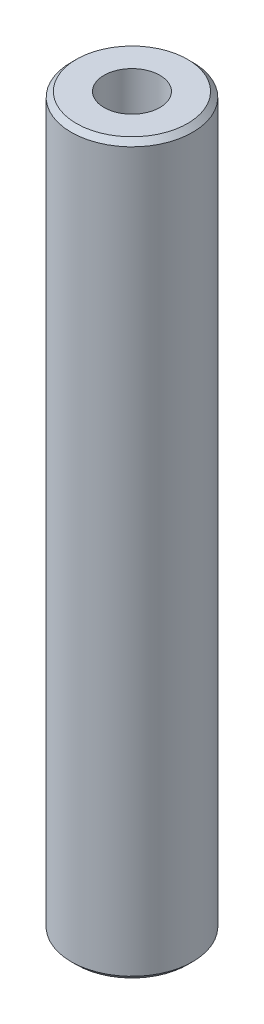
ISO-10303-21;
HEADER;
FILE_DESCRIPTION(('STEP AP214'),'2;1');
FILE_NAME('part.step','',(''),(''),'','','');
FILE_SCHEMA(('AUTOMOTIVE_DESIGN { 1 0 10303 214 1 1 1 1 }'));
ENDSEC;
DATA;
#1=APPLICATION_CONTEXT('core data for automotive mechanical design processes');
#2=APPLICATION_PROTOCOL_DEFINITION('international standard','automotive_design',2000,#1);
#3=PRODUCT_CONTEXT('',#1,'mechanical');
#4=PRODUCT('Part','Part','',(#3));
#5=PRODUCT_RELATED_PRODUCT_CATEGORY('part','',(#4));
#6=PRODUCT_DEFINITION_FORMATION('','',#4);
#7=PRODUCT_DEFINITION_CONTEXT('part definition',#1,'design');
#8=PRODUCT_DEFINITION('design','',#6,#7);
#9=PRODUCT_DEFINITION_SHAPE('','',#8);
#10=(LENGTH_UNIT() NAMED_UNIT(*) SI_UNIT(.MILLI.,.METRE.));
#11=(NAMED_UNIT(*) PLANE_ANGLE_UNIT() SI_UNIT($,.RADIAN.));
#12=(NAMED_UNIT(*) SI_UNIT($,.STERADIAN.) SOLID_ANGLE_UNIT());
#13=UNCERTAINTY_MEASURE_WITH_UNIT(LENGTH_MEASURE(1.E-05),#10,'distance_accuracy_value','');
#14=(GEOMETRIC_REPRESENTATION_CONTEXT(3) GLOBAL_UNCERTAINTY_ASSIGNED_CONTEXT((#13)) GLOBAL_UNIT_ASSIGNED_CONTEXT((#10,
#11,#12)) REPRESENTATION_CONTEXT('',''));
#15=CARTESIAN_POINT('',(0.,0.,0.));
#16=DIRECTION('',(0.,0.,1.));
#17=DIRECTION('',(1.,0.,0.));
#18=AXIS2_PLACEMENT_3D('',#15,#16,#17);
#19=CARTESIAN_POINT('',(0.,600.,0.));
#20=DIRECTION('',(0.,-1.,0.));
#21=DIRECTION('',(0.,0.,-1.));
#22=AXIS2_PLACEMENT_3D('',#19,#20,#21);
#23=CYLINDRICAL_SURFACE('',#22,50.);
#24=CARTESIAN_POINT('',(0.,595.796181627731,0.));
#25=DIRECTION('',(0.,1.,0.));
#26=DIRECTION('',(0.,0.,1.));
#27=AXIS2_PLACEMENT_3D('',#24,#25,#26);
#28=CIRCLE('',#27,50.);
#29=CARTESIAN_POINT('',(0.,595.796181627731,50.));
#30=VERTEX_POINT('',#29);
#31=EDGE_CURVE('E50',#30,#30,#28,.F.);
#32=ORIENTED_EDGE('',*,*,#31,.T.);
#33=EDGE_LOOP('',(#32));
#34=FACE_BOUND('',#33,.T.);
#35=CARTESIAN_POINT('',(0.,4.20381837226858,0.));
#36=DIRECTION('',(0.,1.,0.));
#37=DIRECTION('',(0.,0.,1.));
#38=AXIS2_PLACEMENT_3D('',#35,#36,#37);
#39=CIRCLE('',#38,50.);
#40=CARTESIAN_POINT('',(0.,4.20381837226858,50.));
#41=VERTEX_POINT('',#40);
#42=EDGE_CURVE('E51',#41,#41,#39,.T.);
#43=ORIENTED_EDGE('',*,*,#42,.T.);
#44=EDGE_LOOP('',(#43));
#45=FACE_BOUND('',#44,.T.);
#46=ADVANCED_FACE('F39',(#34,#45),#23,.T.);
#47=CARTESIAN_POINT('',(0.,600.,0.));
#48=DIRECTION('',(0.,1.,0.));
#49=DIRECTION('',(0.,0.,1.));
#50=AXIS2_PLACEMENT_3D('',#47,#48,#49);
#51=PLANE('',#50);
#52=CARTESIAN_POINT('',(0.,600.,0.));
#53=DIRECTION('',(0.,1.,0.));
#54=DIRECTION('',(0.,0.,1.));
#55=AXIS2_PLACEMENT_3D('',#52,#53,#54);
#56=CIRCLE('',#55,45.7961816277313);
#57=CARTESIAN_POINT('',(0.,600.,45.7961816277313));
#58=VERTEX_POINT('',#57);
#59=EDGE_CURVE('E54',#58,#58,#56,.T.);
#60=ORIENTED_EDGE('',*,*,#59,.T.);
#61=EDGE_LOOP('',(#60));
#62=FACE_BOUND('',#61,.T.);
#63=CARTESIAN_POINT('',(0.,600.,0.));
#64=DIRECTION('',(0.,1.,0.));
#65=DIRECTION('',(0.,0.,1.));
#66=AXIS2_PLACEMENT_3D('',#63,#64,#65);
#67=CIRCLE('',#66,23.0156423747646);
#68=CARTESIAN_POINT('',(0.,600.,23.0156423747646));
#69=VERTEX_POINT('',#68);
#70=EDGE_CURVE('E58',#69,#69,#67,.T.);
#71=ORIENTED_EDGE('',*,*,#70,.F.);
#72=EDGE_LOOP('',(#71));
#73=FACE_BOUND('',#72,.T.);
#74=ADVANCED_FACE('F69',(#62,#73),#51,.T.);
#75=CARTESIAN_POINT('',(0.,0.,0.));
#76=DIRECTION('',(0.,1.,0.));
#77=DIRECTION('',(0.,0.,1.));
#78=AXIS2_PLACEMENT_3D('',#75,#76,#77);
#79=PLANE('',#78);
#80=CARTESIAN_POINT('',(0.,0.,0.));
#81=DIRECTION('',(0.,1.,0.));
#82=DIRECTION('',(0.,0.,1.));
#83=AXIS2_PLACEMENT_3D('',#80,#81,#82);
#84=CIRCLE('',#83,45.7961816277314);
#85=CARTESIAN_POINT('',(0.,0.,45.7961816277314));
#86=VERTEX_POINT('',#85);
#87=EDGE_CURVE('E10',#86,#86,#84,.F.);
#88=ORIENTED_EDGE('',*,*,#87,.T.);
#89=EDGE_LOOP('',(#88));
#90=FACE_BOUND('',#89,.T.);
#91=CARTESIAN_POINT('',(0.,0.,0.));
#92=DIRECTION('',(0.,1.,0.));
#93=DIRECTION('',(0.,0.,1.));
#94=AXIS2_PLACEMENT_3D('',#91,#92,#93);
#95=CIRCLE('',#94,23.0156423747646);
#96=CARTESIAN_POINT('',(0.,0.,23.0156423747646));
#97=VERTEX_POINT('',#96);
#98=EDGE_CURVE('E63',#97,#97,#95,.T.);
#99=ORIENTED_EDGE('',*,*,#98,.T.);
#100=EDGE_LOOP('',(#99));
#101=FACE_BOUND('',#100,.T.);
#102=ADVANCED_FACE('F75',(#90,#101),#79,.F.);
#103=CARTESIAN_POINT('',(0.,600.,0.));
#104=DIRECTION('',(0.,-1.,0.));
#105=DIRECTION('',(0.,0.,-1.));
#106=AXIS2_PLACEMENT_3D('',#103,#104,#105);
#107=CYLINDRICAL_SURFACE('',#106,23.0156423747646);
#108=ORIENTED_EDGE('',*,*,#70,.T.);
#109=EDGE_LOOP('',(#108));
#110=FACE_BOUND('',#109,.T.);
#111=ORIENTED_EDGE('',*,*,#98,.F.);
#112=EDGE_LOOP('',(#111));
#113=FACE_BOUND('',#112,.T.);
#114=ADVANCED_FACE('F70',(#110,#113),#107,.F.);
#115=CARTESIAN_POINT('',(0.,600.,0.));
#116=DIRECTION('',(0.,-1.,0.));
#117=DIRECTION('',(0.,0.,-1.));
#118=AXIS2_PLACEMENT_3D('',#115,#116,#117);
#119=CONICAL_SURFACE('',#118,45.7961816277313,0.785398163397437);
#120=ORIENTED_EDGE('',*,*,#31,.F.);
#121=EDGE_LOOP('',(#120));
#122=FACE_BOUND('',#121,.T.);
#123=ORIENTED_EDGE('',*,*,#59,.F.);
#124=EDGE_LOOP('',(#123));
#125=FACE_BOUND('',#124,.T.);
#126=ADVANCED_FACE('F81',(#122,#125),#119,.T.);
#127=CARTESIAN_POINT('',(0.,4.20381837226858,0.));
#128=DIRECTION('',(0.,1.,0.));
#129=DIRECTION('',(0.,0.,1.));
#130=AXIS2_PLACEMENT_3D('',#127,#128,#129);
#131=CONICAL_SURFACE('',#130,50.,0.785398163397456);
#132=ORIENTED_EDGE('',*,*,#87,.F.);
#133=EDGE_LOOP('',(#132));
#134=FACE_BOUND('',#133,.T.);
#135=ORIENTED_EDGE('',*,*,#42,.F.);
#136=EDGE_LOOP('',(#135));
#137=FACE_BOUND('',#136,.T.);
#138=ADVANCED_FACE('F45',(#134,#137),#131,.T.);
#139=CLOSED_SHELL('',(#46,#74,#102,#114,#126,#138));
#140=MANIFOLD_SOLID_BREP('B2',#139);
#141=ADVANCED_BREP_SHAPE_REPRESENTATION('',(#18,#140),#14);
#142=SHAPE_DEFINITION_REPRESENTATION(#9,#141);
ENDSEC;
END-ISO-10303-21;
